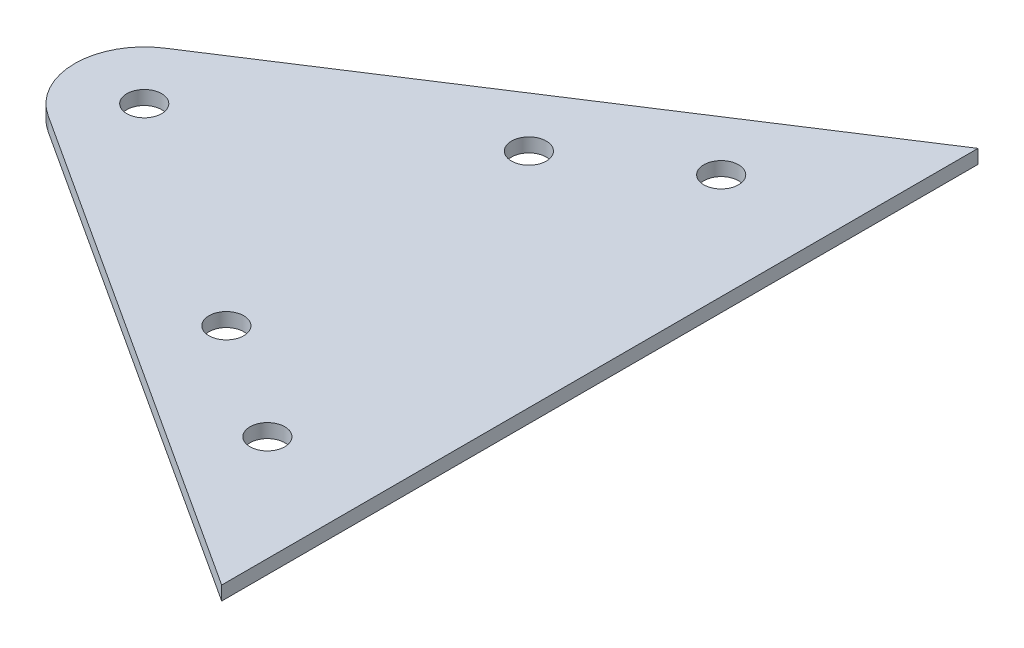
ISO-10303-21;
HEADER;
FILE_DESCRIPTION(('STEP AP214'),'2;1');
FILE_NAME('part.step','',(''),(''),'','','');
FILE_SCHEMA(('AUTOMOTIVE_DESIGN { 1 0 10303 214 1 1 1 1 }'));
ENDSEC;
DATA;
#1=APPLICATION_CONTEXT('core data for automotive mechanical design processes');
#2=APPLICATION_PROTOCOL_DEFINITION('international standard','automotive_design',2000,#1);
#3=PRODUCT_CONTEXT('',#1,'mechanical');
#4=PRODUCT('Part','Part','',(#3));
#5=PRODUCT_RELATED_PRODUCT_CATEGORY('part','',(#4));
#6=PRODUCT_DEFINITION_FORMATION('','',#4);
#7=PRODUCT_DEFINITION_CONTEXT('part definition',#1,'design');
#8=PRODUCT_DEFINITION('design','',#6,#7);
#9=PRODUCT_DEFINITION_SHAPE('','',#8);
#10=(LENGTH_UNIT() NAMED_UNIT(*) SI_UNIT(.MILLI.,.METRE.));
#11=(NAMED_UNIT(*) PLANE_ANGLE_UNIT() SI_UNIT($,.RADIAN.));
#12=(NAMED_UNIT(*) SI_UNIT($,.STERADIAN.) SOLID_ANGLE_UNIT());
#13=UNCERTAINTY_MEASURE_WITH_UNIT(LENGTH_MEASURE(1.E-05),#10,'distance_accuracy_value','');
#14=(GEOMETRIC_REPRESENTATION_CONTEXT(3) GLOBAL_UNCERTAINTY_ASSIGNED_CONTEXT((#13)) GLOBAL_UNIT_ASSIGNED_CONTEXT((#10,
#11,#12)) REPRESENTATION_CONTEXT('',''));
#15=CARTESIAN_POINT('',(0.,0.,0.));
#16=DIRECTION('',(0.,0.,1.));
#17=DIRECTION('',(1.,0.,0.));
#18=AXIS2_PLACEMENT_3D('',#15,#16,#17);
#19=CARTESIAN_POINT('',(-51.1358820780565,2.,-4.24993941334131));
#20=DIRECTION('',(0.,1.,0.));
#21=DIRECTION('',(0.,0.,1.));
#22=AXIS2_PLACEMENT_3D('',#19,#20,#21);
#23=PLANE('',#22);
#24=CARTESIAN_POINT('',(-17.5700606475431,2.,17.5063385701486));
#25=DIRECTION('',(0.,1.,0.));
#26=DIRECTION('',(0.,0.,1.));
#27=AXIS2_PLACEMENT_3D('',#24,#25,#26);
#28=CIRCLE('',#27,2.5);
#29=CARTESIAN_POINT('',(-17.5700606475431,2.,20.0063385701486));
#30=VERTEX_POINT('',#29);
#31=EDGE_CURVE('E127',#30,#30,#28,.T.);
#32=ORIENTED_EDGE('',*,*,#31,.F.);
#33=EDGE_LOOP('',(#32));
#34=FACE_BOUND('',#33,.T.);
#35=CARTESIAN_POINT('',(-17.5700606475431,2.,-26.0062173968312));
#36=DIRECTION('',(0.,1.,0.));
#37=DIRECTION('',(0.,0.,1.));
#38=AXIS2_PLACEMENT_3D('',#35,#36,#37);
#39=CIRCLE('',#38,2.5);
#40=CARTESIAN_POINT('',(-17.5700606475431,2.,-23.5062173968312));
#41=VERTEX_POINT('',#40);
#42=EDGE_CURVE('E115',#41,#41,#39,.T.);
#43=ORIENTED_EDGE('',*,*,#42,.F.);
#44=EDGE_LOOP('',(#43));
#45=FACE_BOUND('',#44,.T.);
#46=DIRECTION('',(0.,0.,-1.));
#47=VECTOR('',#46,1.);
#48=CARTESIAN_POINT('',(14.3931737442662,2.,50.1407555453835));
#49=LINE('',#48,#47);
#50=CARTESIAN_POINT('',(14.3931737442662,2.,50.1407555453835));
#51=VERTEX_POINT('',#50);
#52=CARTESIAN_POINT('',(14.3931737442662,2.,-58.6406343720662));
#53=VERTEX_POINT('',#52);
#54=EDGE_CURVE('E85',#51,#53,#49,.T.);
#55=ORIENTED_EDGE('',*,*,#54,.T.);
#56=DIRECTION('',(-0.839145535762834,0.,0.543906949587249));
#57=VECTOR('',#56,1.);
#58=CARTESIAN_POINT('',(14.3931737442662,2.,-58.6406343720662));
#59=LINE('',#58,#57);
#60=CARTESIAN_POINT('',(-56.5749515739289,2.,-12.6413947709697));
#61=VERTEX_POINT('',#60);
#62=EDGE_CURVE('E80',#53,#61,#59,.T.);
#63=ORIENTED_EDGE('',*,*,#62,.T.);
#64=CARTESIAN_POINT('',(-51.1358820780565,2.,-4.24993941334131));
#65=DIRECTION('',(0.,1.,0.));
#66=DIRECTION('',(0.,0.,1.));
#67=AXIS2_PLACEMENT_3D('',#64,#65,#66);
#68=CIRCLE('',#67,9.99999999999999);
#69=CARTESIAN_POINT('',(-56.5749515739289,2.,4.1415159442871));
#70=VERTEX_POINT('',#69);
#71=EDGE_CURVE('E83',#61,#70,#68,.T.);
#72=ORIENTED_EDGE('',*,*,#71,.T.);
#73=DIRECTION('',(0.839145535762834,0.,0.543906949587248));
#74=VECTOR('',#73,1.);
#75=CARTESIAN_POINT('',(-56.5749515739289,2.,4.1415159442871));
#76=LINE('',#75,#74);
#77=EDGE_CURVE('E50',#70,#51,#76,.T.);
#78=ORIENTED_EDGE('',*,*,#77,.T.);
#79=EDGE_LOOP('',(#55,#63,#72,#78));
#80=FACE_BOUND('',#79,.T.);
#81=CARTESIAN_POINT('',(-51.1358820780565,2.,-4.24993941334131));
#82=DIRECTION('',(0.,1.,0.));
#83=DIRECTION('',(0.,0.,1.));
#84=AXIS2_PLACEMENT_3D('',#81,#82,#83);
#85=CIRCLE('',#84,2.5);
#86=CARTESIAN_POINT('',(-51.1358820780565,2.,-1.7499394133413));
#87=VERTEX_POINT('',#86);
#88=EDGE_CURVE('E100',#87,#87,#85,.T.);
#89=ORIENTED_EDGE('',*,*,#88,.F.);
#90=EDGE_LOOP('',(#89));
#91=FACE_BOUND('',#90,.T.);
#92=CARTESIAN_POINT('',(-0.78714993228641,2.,-36.8843563885762));
#93=DIRECTION('',(0.,1.,0.));
#94=DIRECTION('',(0.,0.,1.));
#95=AXIS2_PLACEMENT_3D('',#92,#93,#94);
#96=CIRCLE('',#95,2.5);
#97=CARTESIAN_POINT('',(-0.78714993228641,2.,-34.3843563885762));
#98=VERTEX_POINT('',#97);
#99=EDGE_CURVE('E121',#98,#98,#96,.T.);
#100=ORIENTED_EDGE('',*,*,#99,.F.);
#101=EDGE_LOOP('',(#100));
#102=FACE_BOUND('',#101,.T.);
#103=CARTESIAN_POINT('',(-0.787149932286404,2.,28.3844775618936));
#104=DIRECTION('',(0.,1.,0.));
#105=DIRECTION('',(0.,0.,1.));
#106=AXIS2_PLACEMENT_3D('',#103,#104,#105);
#107=CIRCLE('',#106,2.5);
#108=CARTESIAN_POINT('',(-0.787149932286404,2.,30.8844775618936));
#109=VERTEX_POINT('',#108);
#110=EDGE_CURVE('E133',#109,#109,#107,.T.);
#111=ORIENTED_EDGE('',*,*,#110,.F.);
#112=EDGE_LOOP('',(#111));
#113=FACE_BOUND('',#112,.T.);
#114=ADVANCED_FACE('F33',(#34,#45,#80,#91,#102,#113),#23,.T.);
#115=CARTESIAN_POINT('',(-51.1358820780565,0.,-4.24993941334131));
#116=DIRECTION('',(0.,1.,0.));
#117=DIRECTION('',(0.,0.,1.));
#118=AXIS2_PLACEMENT_3D('',#115,#116,#117);
#119=PLANE('',#118);
#120=DIRECTION('',(0.,0.,-1.));
#121=VECTOR('',#120,1.);
#122=CARTESIAN_POINT('',(14.3931737442662,0.,50.1407555453835));
#123=LINE('',#122,#121);
#124=CARTESIAN_POINT('',(14.3931737442662,0.,50.1407555453835));
#125=VERTEX_POINT('',#124);
#126=CARTESIAN_POINT('',(14.3931737442662,0.,-58.6406343720662));
#127=VERTEX_POINT('',#126);
#128=EDGE_CURVE('E97',#125,#127,#123,.T.);
#129=ORIENTED_EDGE('',*,*,#128,.F.);
#130=DIRECTION('',(0.839145535762834,0.,0.543906949587248));
#131=VECTOR('',#130,1.);
#132=CARTESIAN_POINT('',(-56.5749515739289,0.,4.1415159442871));
#133=LINE('',#132,#131);
#134=CARTESIAN_POINT('',(-56.5749515739289,0.,4.1415159442871));
#135=VERTEX_POINT('',#134);
#136=EDGE_CURVE('E73',#135,#125,#133,.T.);
#137=ORIENTED_EDGE('',*,*,#136,.F.);
#138=CARTESIAN_POINT('',(-51.1358820780565,0.,-4.24993941334131));
#139=DIRECTION('',(0.,1.,0.));
#140=DIRECTION('',(0.,0.,1.));
#141=AXIS2_PLACEMENT_3D('',#138,#139,#140);
#142=CIRCLE('',#141,9.99999999999999);
#143=CARTESIAN_POINT('',(-56.5749515739289,0.,-12.6413947709697));
#144=VERTEX_POINT('',#143);
#145=EDGE_CURVE('E67',#144,#135,#142,.T.);
#146=ORIENTED_EDGE('',*,*,#145,.F.);
#147=DIRECTION('',(-0.839145535762834,0.,0.543906949587249));
#148=VECTOR('',#147,1.);
#149=CARTESIAN_POINT('',(14.3931737442662,0.,-58.6406343720662));
#150=LINE('',#149,#148);
#151=EDGE_CURVE('E89',#127,#144,#150,.T.);
#152=ORIENTED_EDGE('',*,*,#151,.F.);
#153=EDGE_LOOP('',(#129,#137,#146,#152));
#154=FACE_BOUND('',#153,.T.);
#155=CARTESIAN_POINT('',(-51.1358820780565,0.,-4.24993941334131));
#156=DIRECTION('',(0.,1.,0.));
#157=DIRECTION('',(0.,0.,1.));
#158=AXIS2_PLACEMENT_3D('',#155,#156,#157);
#159=CIRCLE('',#158,2.5);
#160=CARTESIAN_POINT('',(-51.1358820780565,0.,-1.7499394133413));
#161=VERTEX_POINT('',#160);
#162=EDGE_CURVE('E112',#161,#161,#159,.T.);
#163=ORIENTED_EDGE('',*,*,#162,.T.);
#164=EDGE_LOOP('',(#163));
#165=FACE_BOUND('',#164,.T.);
#166=CARTESIAN_POINT('',(-17.5700606475431,0.,-26.0062173968312));
#167=DIRECTION('',(0.,1.,0.));
#168=DIRECTION('',(0.,0.,1.));
#169=AXIS2_PLACEMENT_3D('',#166,#167,#168);
#170=CIRCLE('',#169,2.5);
#171=CARTESIAN_POINT('',(-17.5700606475431,0.,-23.5062173968312));
#172=VERTEX_POINT('',#171);
#173=EDGE_CURVE('E118',#172,#172,#170,.T.);
#174=ORIENTED_EDGE('',*,*,#173,.T.);
#175=EDGE_LOOP('',(#174));
#176=FACE_BOUND('',#175,.T.);
#177=CARTESIAN_POINT('',(-0.78714993228641,0.,-36.8843563885762));
#178=DIRECTION('',(0.,1.,0.));
#179=DIRECTION('',(0.,0.,1.));
#180=AXIS2_PLACEMENT_3D('',#177,#178,#179);
#181=CIRCLE('',#180,2.5);
#182=CARTESIAN_POINT('',(-0.78714993228641,0.,-34.3843563885762));
#183=VERTEX_POINT('',#182);
#184=EDGE_CURVE('E124',#183,#183,#181,.T.);
#185=ORIENTED_EDGE('',*,*,#184,.T.);
#186=EDGE_LOOP('',(#185));
#187=FACE_BOUND('',#186,.T.);
#188=CARTESIAN_POINT('',(-17.5700606475431,0.,17.5063385701486));
#189=DIRECTION('',(0.,1.,0.));
#190=DIRECTION('',(0.,0.,1.));
#191=AXIS2_PLACEMENT_3D('',#188,#189,#190);
#192=CIRCLE('',#191,2.5);
#193=CARTESIAN_POINT('',(-17.5700606475431,0.,20.0063385701486));
#194=VERTEX_POINT('',#193);
#195=EDGE_CURVE('E130',#194,#194,#192,.T.);
#196=ORIENTED_EDGE('',*,*,#195,.T.);
#197=EDGE_LOOP('',(#196));
#198=FACE_BOUND('',#197,.T.);
#199=CARTESIAN_POINT('',(-0.787149932286404,0.,28.3844775618936));
#200=DIRECTION('',(0.,1.,0.));
#201=DIRECTION('',(0.,0.,1.));
#202=AXIS2_PLACEMENT_3D('',#199,#200,#201);
#203=CIRCLE('',#202,2.5);
#204=CARTESIAN_POINT('',(-0.787149932286404,0.,30.8844775618936));
#205=VERTEX_POINT('',#204);
#206=EDGE_CURVE('E136',#205,#205,#203,.T.);
#207=ORIENTED_EDGE('',*,*,#206,.T.);
#208=EDGE_LOOP('',(#207));
#209=FACE_BOUND('',#208,.T.);
#210=ADVANCED_FACE('F108',(#154,#165,#176,#187,#198,#209),#119,.F.);
#211=CARTESIAN_POINT('',(14.3931737442662,2.,50.1407555453835));
#212=DIRECTION('',(-1.,0.,0.));
#213=DIRECTION('',(0.,0.,1.));
#214=AXIS2_PLACEMENT_3D('',#211,#212,#213);
#215=PLANE('',#214);
#216=ORIENTED_EDGE('',*,*,#128,.T.);
#217=DIRECTION('',(0.,-1.,0.));
#218=VECTOR('',#217,1.);
#219=CARTESIAN_POINT('',(14.3931737442662,2.,-58.6406343720662));
#220=LINE('',#219,#218);
#221=EDGE_CURVE('E11',#53,#127,#220,.T.);
#222=ORIENTED_EDGE('',*,*,#221,.F.);
#223=ORIENTED_EDGE('',*,*,#54,.F.);
#224=DIRECTION('',(0.,-1.,0.));
#225=VECTOR('',#224,1.);
#226=CARTESIAN_POINT('',(14.3931737442662,2.,50.1407555453835));
#227=LINE('',#226,#225);
#228=EDGE_CURVE('E93',#51,#125,#227,.T.);
#229=ORIENTED_EDGE('',*,*,#228,.T.);
#230=EDGE_LOOP('',(#216,#222,#223,#229));
#231=FACE_BOUND('',#230,.T.);
#232=ADVANCED_FACE('F35',(#231),#215,.F.);
#233=CARTESIAN_POINT('',(14.3931737442662,2.,-58.6406343720662));
#234=DIRECTION('',(0.543906949587249,0.,0.839145535762834));
#235=DIRECTION('',(0.839145535762834,0.,-0.543906949587249));
#236=AXIS2_PLACEMENT_3D('',#233,#234,#235);
#237=PLANE('',#236);
#238=ORIENTED_EDGE('',*,*,#151,.T.);
#239=DIRECTION('',(0.,-1.,0.));
#240=VECTOR('',#239,1.);
#241=CARTESIAN_POINT('',(-56.5749515739289,2.,-12.6413947709697));
#242=LINE('',#241,#240);
#243=EDGE_CURVE('E42',#61,#144,#242,.T.);
#244=ORIENTED_EDGE('',*,*,#243,.F.);
#245=ORIENTED_EDGE('',*,*,#62,.F.);
#246=ORIENTED_EDGE('',*,*,#221,.T.);
#247=EDGE_LOOP('',(#238,#244,#245,#246));
#248=FACE_BOUND('',#247,.T.);
#249=ADVANCED_FACE('F88',(#248),#237,.F.);
#250=CARTESIAN_POINT('',(-51.1358820780565,2.,-4.24993941334131));
#251=DIRECTION('',(0.,-1.,0.));
#252=DIRECTION('',(0.,0.,-1.));
#253=AXIS2_PLACEMENT_3D('',#250,#251,#252);
#254=CYLINDRICAL_SURFACE('',#253,9.99999999999999);
#255=ORIENTED_EDGE('',*,*,#145,.T.);
#256=DIRECTION('',(0.,-1.,0.));
#257=VECTOR('',#256,1.);
#258=CARTESIAN_POINT('',(-56.5749515739289,2.,4.1415159442871));
#259=LINE('',#258,#257);
#260=EDGE_CURVE('E90',#70,#135,#259,.T.);
#261=ORIENTED_EDGE('',*,*,#260,.F.);
#262=ORIENTED_EDGE('',*,*,#71,.F.);
#263=ORIENTED_EDGE('',*,*,#243,.T.);
#264=EDGE_LOOP('',(#255,#261,#262,#263));
#265=FACE_BOUND('',#264,.T.);
#266=ADVANCED_FACE('F91',(#265),#254,.T.);
#267=CARTESIAN_POINT('',(-56.5749515739289,2.,4.1415159442871));
#268=DIRECTION('',(0.543906949587248,0.,-0.839145535762835));
#269=DIRECTION('',(-0.839145535762835,0.,-0.543906949587248));
#270=AXIS2_PLACEMENT_3D('',#267,#268,#269);
#271=PLANE('',#270);
#272=ORIENTED_EDGE('',*,*,#136,.T.);
#273=ORIENTED_EDGE('',*,*,#228,.F.);
#274=ORIENTED_EDGE('',*,*,#77,.F.);
#275=ORIENTED_EDGE('',*,*,#260,.T.);
#276=EDGE_LOOP('',(#272,#273,#274,#275));
#277=FACE_BOUND('',#276,.T.);
#278=ADVANCED_FACE('F105',(#277),#271,.F.);
#279=CARTESIAN_POINT('',(-51.1358820780565,2.,-4.24993941334131));
#280=DIRECTION('',(0.,-1.,0.));
#281=DIRECTION('',(0.,0.,-1.));
#282=AXIS2_PLACEMENT_3D('',#279,#280,#281);
#283=CYLINDRICAL_SURFACE('',#282,2.5);
#284=ORIENTED_EDGE('',*,*,#88,.T.);
#285=EDGE_LOOP('',(#284));
#286=FACE_BOUND('',#285,.T.);
#287=ORIENTED_EDGE('',*,*,#162,.F.);
#288=EDGE_LOOP('',(#287));
#289=FACE_BOUND('',#288,.T.);
#290=ADVANCED_FACE('F155',(#286,#289),#283,.F.);
#291=CARTESIAN_POINT('',(-17.5700606475431,2.,-26.0062173968312));
#292=DIRECTION('',(0.,-1.,0.));
#293=DIRECTION('',(0.,0.,-1.));
#294=AXIS2_PLACEMENT_3D('',#291,#292,#293);
#295=CYLINDRICAL_SURFACE('',#294,2.5);
#296=ORIENTED_EDGE('',*,*,#42,.T.);
#297=EDGE_LOOP('',(#296));
#298=FACE_BOUND('',#297,.T.);
#299=ORIENTED_EDGE('',*,*,#173,.F.);
#300=EDGE_LOOP('',(#299));
#301=FACE_BOUND('',#300,.T.);
#302=ADVANCED_FACE('F201',(#298,#301),#295,.F.);
#303=CARTESIAN_POINT('',(-0.78714993228641,2.,-36.8843563885762));
#304=DIRECTION('',(0.,-1.,0.));
#305=DIRECTION('',(0.,0.,-1.));
#306=AXIS2_PLACEMENT_3D('',#303,#304,#305);
#307=CYLINDRICAL_SURFACE('',#306,2.5);
#308=ORIENTED_EDGE('',*,*,#99,.T.);
#309=EDGE_LOOP('',(#308));
#310=FACE_BOUND('',#309,.T.);
#311=ORIENTED_EDGE('',*,*,#184,.F.);
#312=EDGE_LOOP('',(#311));
#313=FACE_BOUND('',#312,.T.);
#314=ADVANCED_FACE('F209',(#310,#313),#307,.F.);
#315=CARTESIAN_POINT('',(-17.5700606475431,2.,17.5063385701486));
#316=DIRECTION('',(0.,-1.,0.));
#317=DIRECTION('',(0.,0.,-1.));
#318=AXIS2_PLACEMENT_3D('',#315,#316,#317);
#319=CYLINDRICAL_SURFACE('',#318,2.5);
#320=ORIENTED_EDGE('',*,*,#31,.T.);
#321=EDGE_LOOP('',(#320));
#322=FACE_BOUND('',#321,.T.);
#323=ORIENTED_EDGE('',*,*,#195,.F.);
#324=EDGE_LOOP('',(#323));
#325=FACE_BOUND('',#324,.T.);
#326=ADVANCED_FACE('F217',(#322,#325),#319,.F.);
#327=CARTESIAN_POINT('',(-0.787149932286404,2.,28.3844775618936));
#328=DIRECTION('',(0.,-1.,0.));
#329=DIRECTION('',(0.,0.,-1.));
#330=AXIS2_PLACEMENT_3D('',#327,#328,#329);
#331=CYLINDRICAL_SURFACE('',#330,2.5);
#332=ORIENTED_EDGE('',*,*,#110,.T.);
#333=EDGE_LOOP('',(#332));
#334=FACE_BOUND('',#333,.T.);
#335=ORIENTED_EDGE('',*,*,#206,.F.);
#336=EDGE_LOOP('',(#335));
#337=FACE_BOUND('',#336,.T.);
#338=ADVANCED_FACE('F142',(#334,#337),#331,.F.);
#339=CLOSED_SHELL('',(#114,#210,#232,#249,#266,#278,#290,#302,#314,#326,#338));
#340=MANIFOLD_SOLID_BREP('B2',#339);
#341=ADVANCED_BREP_SHAPE_REPRESENTATION('',(#18,#340),#14);
#342=SHAPE_DEFINITION_REPRESENTATION(#9,#341);
ENDSEC;
END-ISO-10303-21;
